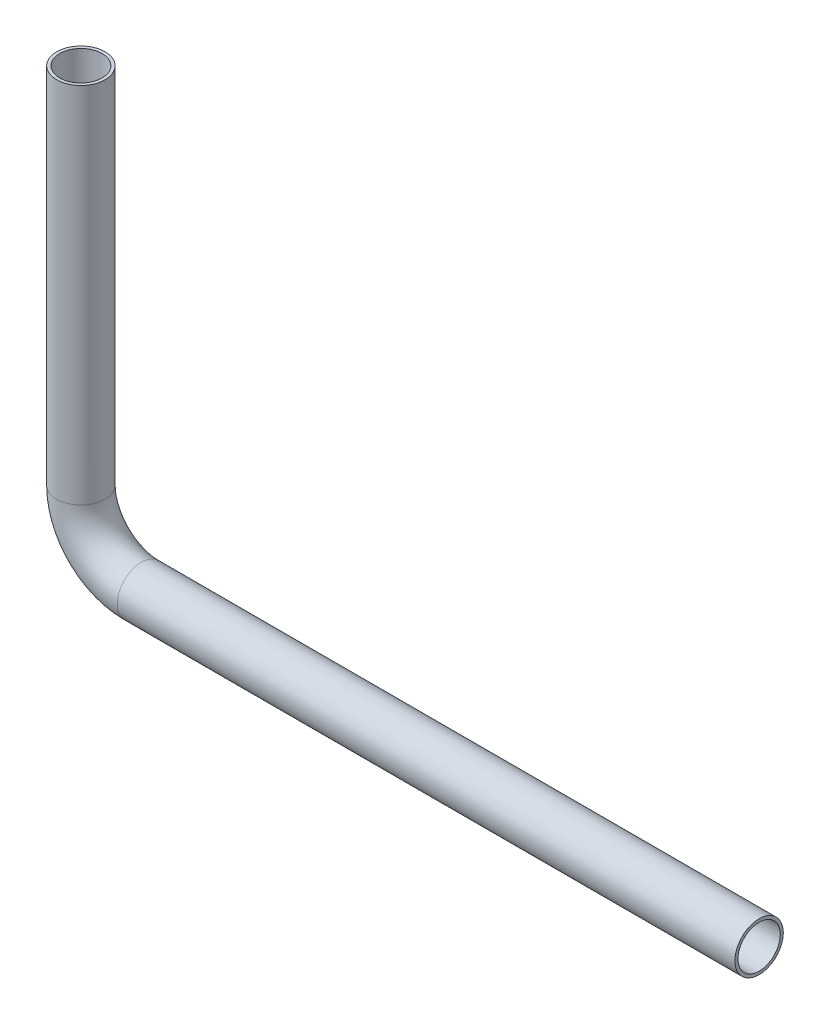
ISO-10303-21;
HEADER;
FILE_DESCRIPTION(('STEP AP214'),'2;1');
FILE_NAME('part.step','',(''),(''),'','','');
FILE_SCHEMA(('AUTOMOTIVE_DESIGN { 1 0 10303 214 1 1 1 1 }'));
ENDSEC;
DATA;
#1=APPLICATION_CONTEXT('core data for automotive mechanical design processes');
#2=APPLICATION_PROTOCOL_DEFINITION('international standard','automotive_design',2000,#1);
#3=PRODUCT_CONTEXT('',#1,'mechanical');
#4=PRODUCT('Part','Part','',(#3));
#5=PRODUCT_RELATED_PRODUCT_CATEGORY('part','',(#4));
#6=PRODUCT_DEFINITION_FORMATION('','',#4);
#7=PRODUCT_DEFINITION_CONTEXT('part definition',#1,'design');
#8=PRODUCT_DEFINITION('design','',#6,#7);
#9=PRODUCT_DEFINITION_SHAPE('','',#8);
#10=(LENGTH_UNIT() NAMED_UNIT(*) SI_UNIT(.MILLI.,.METRE.));
#11=(NAMED_UNIT(*) PLANE_ANGLE_UNIT() SI_UNIT($,.RADIAN.));
#12=(NAMED_UNIT(*) SI_UNIT($,.STERADIAN.) SOLID_ANGLE_UNIT());
#13=UNCERTAINTY_MEASURE_WITH_UNIT(LENGTH_MEASURE(1.E-05),#10,'distance_accuracy_value','');
#14=(GEOMETRIC_REPRESENTATION_CONTEXT(3) GLOBAL_UNCERTAINTY_ASSIGNED_CONTEXT((#13)) GLOBAL_UNIT_ASSIGNED_CONTEXT((#10,
#11,#12)) REPRESENTATION_CONTEXT('',''));
#15=CARTESIAN_POINT('',(0.,0.,0.));
#16=DIRECTION('',(0.,0.,1.));
#17=DIRECTION('',(1.,0.,0.));
#18=AXIS2_PLACEMENT_3D('',#15,#16,#17);
#19=CARTESIAN_POINT('',(0.,0.,0.));
#20=DIRECTION('',(1.,0.,0.));
#21=DIRECTION('',(0.,0.,-1.));
#22=AXIS2_PLACEMENT_3D('',#19,#20,#21);
#23=PLANE('',#22);
#24=CARTESIAN_POINT('',(0.,0.,0.));
#25=DIRECTION('',(1.,0.,0.));
#26=DIRECTION('',(0.,0.,-1.));
#27=AXIS2_PLACEMENT_3D('',#24,#25,#26);
#28=CIRCLE('',#27,3.5);
#29=CARTESIAN_POINT('',(0.,0.,-3.5));
#30=VERTEX_POINT('',#29);
#31=EDGE_CURVE('E108',#30,#30,#28,.T.);
#32=ORIENTED_EDGE('',*,*,#31,.F.);
#33=EDGE_LOOP('',(#32));
#34=FACE_BOUND('',#33,.T.);
#35=CARTESIAN_POINT('',(0.,0.,0.));
#36=DIRECTION('',(1.,0.,0.));
#37=DIRECTION('',(0.,0.,-1.));
#38=AXIS2_PLACEMENT_3D('',#35,#36,#37);
#39=CIRCLE('',#38,4.);
#40=CARTESIAN_POINT('',(0.,0.,-4.));
#41=VERTEX_POINT('',#40);
#42=EDGE_CURVE('E61',#41,#41,#39,.T.);
#43=ORIENTED_EDGE('',*,*,#42,.T.);
#44=EDGE_LOOP('',(#43));
#45=FACE_BOUND('',#44,.T.);
#46=ADVANCED_FACE('F49',(#34,#45),#23,.T.);
#47=CARTESIAN_POINT('',(-112.,70.,0.));
#48=DIRECTION('',(0.,-1.,0.));
#49=DIRECTION('',(0.,0.,-1.));
#50=AXIS2_PLACEMENT_3D('',#47,#48,#49);
#51=PLANE('',#50);
#52=CARTESIAN_POINT('',(-112.,70.,0.));
#53=DIRECTION('',(0.,-1.,0.));
#54=DIRECTION('',(0.,0.,-1.));
#55=AXIS2_PLACEMENT_3D('',#52,#53,#54);
#56=CIRCLE('',#55,3.5);
#57=CARTESIAN_POINT('',(-112.,70.,-3.5));
#58=VERTEX_POINT('',#57);
#59=EDGE_CURVE('E110',#58,#58,#56,.T.);
#60=ORIENTED_EDGE('',*,*,#59,.T.);
#61=EDGE_LOOP('',(#60));
#62=FACE_BOUND('',#61,.T.);
#63=CARTESIAN_POINT('',(-112.,70.,0.));
#64=DIRECTION('',(0.,-1.,0.));
#65=DIRECTION('',(0.,0.,-1.));
#66=AXIS2_PLACEMENT_3D('',#63,#64,#65);
#67=CIRCLE('',#66,4.);
#68=CARTESIAN_POINT('',(-112.,70.,-4.));
#69=VERTEX_POINT('',#68);
#70=EDGE_CURVE('E12',#69,#69,#67,.T.);
#71=ORIENTED_EDGE('',*,*,#70,.F.);
#72=EDGE_LOOP('',(#71));
#73=FACE_BOUND('',#72,.T.);
#74=ADVANCED_FACE('F67',(#62,#73),#51,.F.);
#75=CARTESIAN_POINT('',(0.,0.,0.));
#76=DIRECTION('',(-1.,0.,0.));
#77=DIRECTION('',(0.,0.,1.));
#78=AXIS2_PLACEMENT_3D('',#75,#76,#77);
#79=CYLINDRICAL_SURFACE('',#78,4.);
#80=CARTESIAN_POINT('',(-102.,0.,0.));
#81=DIRECTION('',(1.,0.,0.));
#82=DIRECTION('',(0.,0.,-1.));
#83=AXIS2_PLACEMENT_3D('',#80,#81,#82);
#84=CIRCLE('',#83,4.);
#85=CARTESIAN_POINT('',(-102.,-4.,0.));
#86=VERTEX_POINT('',#85);
#87=EDGE_CURVE('E117',#86,#86,#84,.T.);
#88=ORIENTED_EDGE('',*,*,#87,.T.);
#89=EDGE_LOOP('',(#88));
#90=FACE_BOUND('',#89,.T.);
#91=ORIENTED_EDGE('',*,*,#42,.F.);
#92=EDGE_LOOP('',(#91));
#93=FACE_BOUND('',#92,.T.);
#94=ADVANCED_FACE('F69',(#90,#93),#79,.T.);
#95=CARTESIAN_POINT('',(-102.,10.,0.));
#96=DIRECTION('',(0.,0.,-1.));
#97=DIRECTION('',(-1.,0.,0.));
#98=AXIS2_PLACEMENT_3D('',#95,#96,#97);
#99=TOROIDAL_SURFACE('',#98,10.,4.);
#100=CARTESIAN_POINT('',(-112.,10.,0.));
#101=DIRECTION('',(0.,-1.,0.));
#102=DIRECTION('',(0.,0.,-1.));
#103=AXIS2_PLACEMENT_3D('',#100,#101,#102);
#104=CIRCLE('',#103,4.);
#105=CARTESIAN_POINT('',(-116.,10.,0.));
#106=VERTEX_POINT('',#105);
#107=EDGE_CURVE('E56',#106,#106,#104,.T.);
#108=CARTESIAN_POINT('',(-102.,10.,0.));
#109=DIRECTION('',(0.,0.,-1.));
#110=DIRECTION('',(-1.,0.,0.));
#111=AXIS2_PLACEMENT_3D('',#108,#109,#110);
#112=CIRCLE('',#111,14.);
#113=EDGE_CURVE('',#86,#106,#112,.T.);
#114=ORIENTED_EDGE('',*,*,#87,.F.);
#115=ORIENTED_EDGE('',*,*,#107,.T.);
#116=ORIENTED_EDGE('',*,*,#113,.T.);
#117=ORIENTED_EDGE('',*,*,#113,.F.);
#118=EDGE_LOOP('',(#114,#116,#115,#117));
#119=FACE_BOUND('',#118,.T.);
#120=ADVANCED_FACE('F75',(#119),#99,.T.);
#121=CARTESIAN_POINT('',(-112.,10.,0.));
#122=DIRECTION('',(0.,1.,0.));
#123=DIRECTION('',(0.,0.,1.));
#124=AXIS2_PLACEMENT_3D('',#121,#122,#123);
#125=CYLINDRICAL_SURFACE('',#124,4.);
#126=ORIENTED_EDGE('',*,*,#70,.T.);
#127=EDGE_LOOP('',(#126));
#128=FACE_BOUND('',#127,.T.);
#129=ORIENTED_EDGE('',*,*,#107,.F.);
#130=EDGE_LOOP('',(#129));
#131=FACE_BOUND('',#130,.T.);
#132=ADVANCED_FACE('F64',(#128,#131),#125,.T.);
#133=CARTESIAN_POINT('',(0.,0.,0.));
#134=DIRECTION('',(-1.,0.,0.));
#135=DIRECTION('',(0.,0.,1.));
#136=AXIS2_PLACEMENT_3D('',#133,#134,#135);
#137=CYLINDRICAL_SURFACE('',#136,3.5);
#138=CARTESIAN_POINT('',(-102.,0.,0.));
#139=DIRECTION('',(-1.,0.,0.));
#140=DIRECTION('',(0.,0.,1.));
#141=AXIS2_PLACEMENT_3D('',#138,#139,#140);
#142=CIRCLE('',#141,3.5);
#143=CARTESIAN_POINT('',(-102.,-3.5,0.));
#144=VERTEX_POINT('',#143);
#145=EDGE_CURVE('E107',#144,#144,#142,.F.);
#146=ORIENTED_EDGE('',*,*,#145,.F.);
#147=EDGE_LOOP('',(#146));
#148=FACE_BOUND('',#147,.T.);
#149=ORIENTED_EDGE('',*,*,#31,.T.);
#150=EDGE_LOOP('',(#149));
#151=FACE_BOUND('',#150,.T.);
#152=ADVANCED_FACE('F83',(#148,#151),#137,.F.);
#153=CARTESIAN_POINT('',(-102.,10.,0.));
#154=DIRECTION('',(0.,0.,-1.));
#155=DIRECTION('',(-1.,0.,0.));
#156=AXIS2_PLACEMENT_3D('',#153,#154,#155);
#157=TOROIDAL_SURFACE('',#156,10.,3.5);
#158=CARTESIAN_POINT('',(-112.,10.,0.));
#159=DIRECTION('',(0.,-1.,0.));
#160=DIRECTION('',(1.,0.,0.));
#161=AXIS2_PLACEMENT_3D('',#158,#159,#160);
#162=CIRCLE('',#161,3.5);
#163=CARTESIAN_POINT('',(-115.5,10.,0.));
#164=VERTEX_POINT('',#163);
#165=EDGE_CURVE('E104',#164,#164,#162,.T.);
#166=CARTESIAN_POINT('',(-102.,10.,0.));
#167=DIRECTION('',(0.,0.,-1.));
#168=DIRECTION('',(-1.,0.,0.));
#169=AXIS2_PLACEMENT_3D('',#166,#167,#168);
#170=CIRCLE('',#169,13.5);
#171=EDGE_CURVE('',#144,#164,#170,.T.);
#172=ORIENTED_EDGE('',*,*,#145,.T.);
#173=ORIENTED_EDGE('',*,*,#165,.F.);
#174=ORIENTED_EDGE('',*,*,#171,.T.);
#175=ORIENTED_EDGE('',*,*,#171,.F.);
#176=EDGE_LOOP('',(#172,#174,#173,#175));
#177=FACE_BOUND('',#176,.T.);
#178=ADVANCED_FACE('F88',(#177),#157,.F.);
#179=CARTESIAN_POINT('',(-112.,10.,0.));
#180=DIRECTION('',(0.,1.,0.));
#181=DIRECTION('',(0.,0.,1.));
#182=AXIS2_PLACEMENT_3D('',#179,#180,#181);
#183=CYLINDRICAL_SURFACE('',#182,3.5);
#184=ORIENTED_EDGE('',*,*,#59,.F.);
#185=EDGE_LOOP('',(#184));
#186=FACE_BOUND('',#185,.T.);
#187=ORIENTED_EDGE('',*,*,#165,.T.);
#188=EDGE_LOOP('',(#187));
#189=FACE_BOUND('',#188,.T.);
#190=ADVANCED_FACE('F79',(#186,#189),#183,.F.);
#191=CLOSED_SHELL('',(#46,#74,#94,#120,#132,#152,#178,#190));
#192=MANIFOLD_SOLID_BREP('B2',#191);
#193=ADVANCED_BREP_SHAPE_REPRESENTATION('',(#18,#192),#14);
#194=SHAPE_DEFINITION_REPRESENTATION(#9,#193);
ENDSEC;
END-ISO-10303-21;
